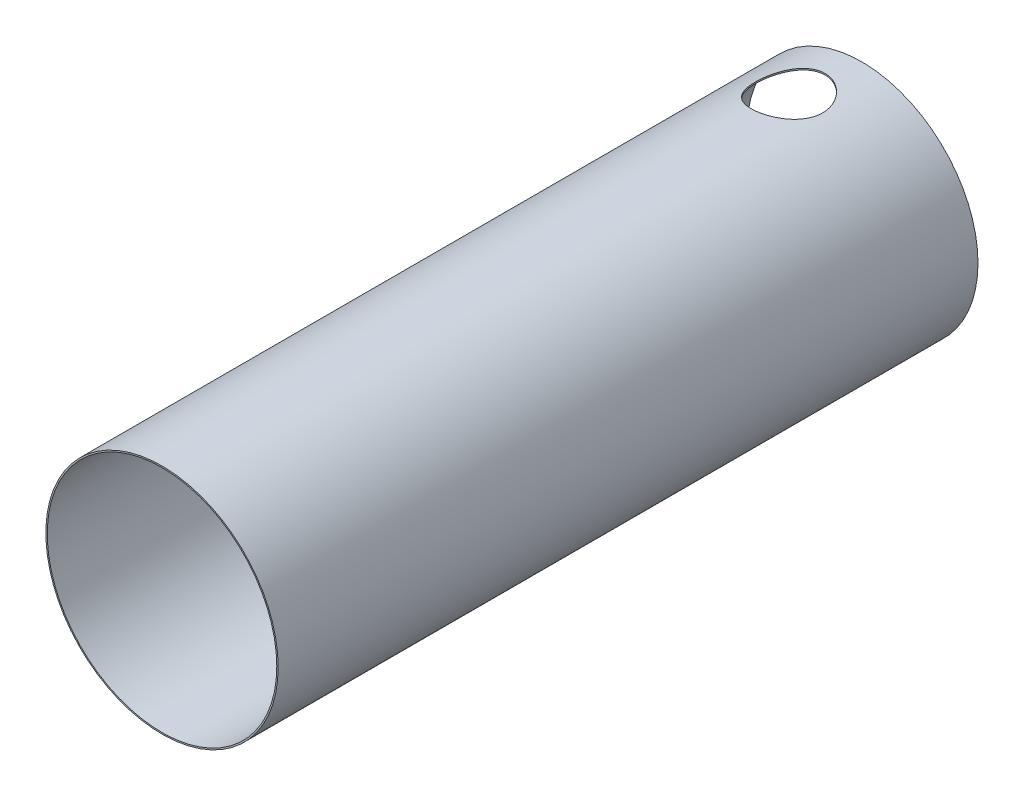
ISO-10303-21;
HEADER;
FILE_DESCRIPTION(('STEP AP214'),'2;1');
FILE_NAME('part.step','',(''),(''),'','','');
FILE_SCHEMA(('AUTOMOTIVE_DESIGN { 1 0 10303 214 1 1 1 1 }'));
ENDSEC;
DATA;
#1=APPLICATION_CONTEXT('core data for automotive mechanical design processes');
#2=APPLICATION_PROTOCOL_DEFINITION('international standard','automotive_design',2000,#1);
#3=PRODUCT_CONTEXT('',#1,'mechanical');
#4=PRODUCT('Part','Part','',(#3));
#5=PRODUCT_RELATED_PRODUCT_CATEGORY('part','',(#4));
#6=PRODUCT_DEFINITION_FORMATION('','',#4);
#7=PRODUCT_DEFINITION_CONTEXT('part definition',#1,'design');
#8=PRODUCT_DEFINITION('design','',#6,#7);
#9=PRODUCT_DEFINITION_SHAPE('','',#8);
#10=(LENGTH_UNIT() NAMED_UNIT(*) SI_UNIT(.MILLI.,.METRE.));
#11=(NAMED_UNIT(*) PLANE_ANGLE_UNIT() SI_UNIT($,.RADIAN.));
#12=(NAMED_UNIT(*) SI_UNIT($,.STERADIAN.) SOLID_ANGLE_UNIT());
#13=UNCERTAINTY_MEASURE_WITH_UNIT(LENGTH_MEASURE(1.E-05),#10,'distance_accuracy_value','');
#14=(GEOMETRIC_REPRESENTATION_CONTEXT(3) GLOBAL_UNCERTAINTY_ASSIGNED_CONTEXT((#13)) GLOBAL_UNIT_ASSIGNED_CONTEXT((#10,
#11,#12)) REPRESENTATION_CONTEXT('',''));
#15=CARTESIAN_POINT('',(0.,0.,0.));
#16=DIRECTION('',(0.,0.,1.));
#17=DIRECTION('',(1.,0.,0.));
#18=AXIS2_PLACEMENT_3D('',#15,#16,#17);
#19=CARTESIAN_POINT('',(0.,0.,125.));
#20=DIRECTION('',(0.,0.,-1.));
#21=DIRECTION('',(-1.,0.,0.));
#22=AXIS2_PLACEMENT_3D('',#19,#20,#21);
#23=CYLINDRICAL_SURFACE('',#22,20.75);
#24=CARTESIAN_POINT('',(0.,0.,125.));
#25=DIRECTION('',(0.,0.,1.));
#26=DIRECTION('',(1.,0.,0.));
#27=AXIS2_PLACEMENT_3D('',#24,#25,#26);
#28=CIRCLE('',#27,20.75);
#29=CARTESIAN_POINT('',(20.75,0.,125.));
#30=VERTEX_POINT('',#29);
#31=EDGE_CURVE('E10',#30,#30,#28,.T.);
#32=ORIENTED_EDGE('',*,*,#31,.F.);
#33=EDGE_LOOP('',(#32));
#34=FACE_BOUND('',#33,.T.);
#35=CARTESIAN_POINT('',(0.,0.,0.));
#36=DIRECTION('',(0.,0.,1.));
#37=DIRECTION('',(1.,0.,0.));
#38=AXIS2_PLACEMENT_3D('',#35,#36,#37);
#39=CIRCLE('',#38,20.75);
#40=CARTESIAN_POINT('',(20.75,0.,0.));
#41=VERTEX_POINT('',#40);
#42=EDGE_CURVE('E40',#41,#41,#39,.T.);
#43=ORIENTED_EDGE('',*,*,#42,.T.);
#44=EDGE_LOOP('',(#43));
#45=FACE_BOUND('',#44,.T.);
#46=CARTESIAN_POINT('',(0.,20.75,5.34314575050762));
#47=CARTESIAN_POINT('',(-0.308284348277854,20.749996274708,5.23415517832771));
#48=CARTESIAN_POINT('',(-0.625546052269505,20.7430677967777,5.15042043919961));
#49=CARTESIAN_POINT('',(-1.26880031894893,20.7136741379048,5.03576464771178));
#50=CARTESIAN_POINT('',(-1.5947938933867,20.6912071489848,5.00484974263634));
#51=CARTESIAN_POINT('',(-2.24577157618452,20.6307005624102,4.99620944335513));
#52=CARTESIAN_POINT('',(-2.57075623479811,20.5926719718474,5.01844650720648));
#53=CARTESIAN_POINT('',(-3.21097157594953,20.5026029820886,5.11456373053897));
#54=CARTESIAN_POINT('',(-3.52620122308127,20.4505611011572,5.18844935254706));
#55=CARTESIAN_POINT('',(-4.14367969794329,20.3345213933555,5.38649037897963));
#56=CARTESIAN_POINT('',(-4.44564596745551,20.2703482088581,5.51141902353659));
#57=CARTESIAN_POINT('',(-5.02426884691195,20.1347345582193,5.80775554531744));
#58=CARTESIAN_POINT('',(-5.30091864525203,20.0632921470885,5.97917588262454));
#59=CARTESIAN_POINT('',(-5.69824383795414,19.9527637710043,6.27221874305129));
#60=CARTESIAN_POINT('',(-5.83053053497626,19.9144467710481,6.37875778362752));
#61=CARTESIAN_POINT('',(-6.08561921158665,19.8379792586638,6.60267396999102));
#62=CARTESIAN_POINT('',(-6.20842435176895,19.7998286947917,6.72004747530968));
#63=CARTESIAN_POINT('',(-6.44384700777414,19.7244680032407,6.96501413967316));
#64=CARTESIAN_POINT('',(-6.55645823691378,19.6872584659575,7.09261351489714));
#65=CARTESIAN_POINT('',(-6.7706183592017,19.6146375367174,7.35717839668783));
#66=CARTESIAN_POINT('',(-6.87217164102685,19.5792254343956,7.49414015212498));
#67=CARTESIAN_POINT('',(-7.06490837914687,19.5105149438053,7.77871730599308));
#68=CARTESIAN_POINT('',(-7.15591999695103,19.4772546791392,7.92645844847072));
#69=CARTESIAN_POINT('',(-7.32504503275851,19.4142823412594,8.22979514593471));
#70=CARTESIAN_POINT('',(-7.40316367988142,19.3845688309163,8.38538748304237));
#71=CARTESIAN_POINT('',(-7.54580652680447,19.329489206932,8.70339561940604));
#72=CARTESIAN_POINT('',(-7.61033332462784,19.3041222626368,8.86581010750564));
#73=CARTESIAN_POINT('',(-7.72513990922679,19.2584666117551,9.19629114247564));
#74=CARTESIAN_POINT('',(-7.77542067574542,19.238177555958,9.36435729977375));
#75=CARTESIAN_POINT('',(-7.85878390609851,19.2042684344528,9.69534022455071));
#76=CARTESIAN_POINT('',(-7.89266691124722,19.1903403880965,9.85802403471899));
#77=CARTESIAN_POINT('',(-7.94685100783337,19.1679660409706,10.1860067824037));
#78=CARTESIAN_POINT('',(-7.96715297705305,19.1595193859236,10.3513055502006));
#79=CARTESIAN_POINT('',(-7.99393971476636,19.1483586561001,10.6831574902856));
#80=CARTESIAN_POINT('',(-8.00042901675062,19.1456427004386,10.8497102329868));
#81=CARTESIAN_POINT('',(-7.999527029626,19.1460196625222,11.1827687636201));
#82=CARTESIAN_POINT('',(-7.99213623068553,19.1491123751371,11.3492745530027));
#83=CARTESIAN_POINT('',(-7.96441318270808,19.1606583429308,11.6710309010101));
#84=CARTESIAN_POINT('',(-7.94487565298543,19.1687823029281,11.8263625774602));
#85=CARTESIAN_POINT('',(-7.8937905047736,19.1898758376795,12.1347553708834));
#86=CARTESIAN_POINT('',(-7.86223897797181,19.2028469892637,12.2878157321149));
#87=CARTESIAN_POINT('',(-7.78744194660948,19.2333011913335,12.5905404579474));
#88=CARTESIAN_POINT('',(-7.74419983977725,19.250782930803,12.740205795594));
#89=CARTESIAN_POINT('',(-7.6463921526522,19.2898408073321,13.0352960344339));
#90=CARTESIAN_POINT('',(-7.59182224392198,19.311418509219,13.1807192903995));
#91=CARTESIAN_POINT('',(-7.47075082893734,19.3585814083041,13.4689564360748));
#92=CARTESIAN_POINT('',(-7.40405454855893,19.3842309989868,13.6116780511512));
#93=CARTESIAN_POINT('',(-7.25993057824466,19.4386686892299,13.8909959564151));
#94=CARTESIAN_POINT('',(-7.18249903392975,19.4674579152462,14.0275900231549));
#95=CARTESIAN_POINT('',(-6.9349438763407,19.5576048296629,14.4270020184708));
#96=CARTESIAN_POINT('',(-6.74947804585195,19.6227746215848,14.6796429332964));
#97=CARTESIAN_POINT('',(-6.32813746011946,19.7628339976407,15.1687560202298));
#98=CARTESIAN_POINT('',(-6.08965348704846,19.8380843648092,15.4028807199967));
#99=CARTESIAN_POINT('',(-5.70550960414979,19.9506287064117,15.7219715191203));
#100=CARTESIAN_POINT('',(-5.57296617066683,19.9881119591239,15.8230396537303));
#101=CARTESIAN_POINT('',(-5.29979412520633,20.0622698564665,16.0138890304446));
#102=CARTESIAN_POINT('',(-5.15916827898489,20.0989447718318,16.1036741004307));
#103=CARTESIAN_POINT('',(-4.86529554150678,20.1721385984021,16.2744699784405));
#104=CARTESIAN_POINT('',(-4.71177405615301,20.2086013573788,16.3550322987335));
#105=CARTESIAN_POINT('',(-4.39795322979504,20.279210003387,16.5027154912608));
#106=CARTESIAN_POINT('',(-4.23765650826997,20.3133567727771,16.569841501771));
#107=CARTESIAN_POINT('',(-3.911268786829,20.3787188261571,16.6901060515149));
#108=CARTESIAN_POINT('',(-3.74517636848009,20.4099333855211,16.7432411390442));
#109=CARTESIAN_POINT('',(-3.40848523289161,20.468852380501,16.8349460469068));
#110=CARTESIAN_POINT('',(-3.23788857225608,20.4965583857134,16.8735223956826));
#111=CARTESIAN_POINT('',(-2.8985121102425,20.5472549514753,16.9347721064773));
#112=CARTESIAN_POINT('',(-2.72982858514179,20.5703610311751,16.957883358767));
#113=CARTESIAN_POINT('',(-2.39067286991908,20.612529407172,16.9896886329033));
#114=CARTESIAN_POINT('',(-2.2202014517096,20.6315933788389,16.9983886381379));
#115=CARTESIAN_POINT('',(-1.87872290516064,20.665486652523,17.0012036039102));
#116=CARTESIAN_POINT('',(-1.70771579885765,20.6803161264799,16.9953191567364));
#117=CARTESIAN_POINT('',(-1.36651480184561,20.7056610422893,16.9689171757462));
#118=CARTESIAN_POINT('',(-1.19632088565387,20.7161766202129,16.9484001035359));
#119=CARTESIAN_POINT('',(-0.865656075911721,20.7325665120861,16.8940711234785));
#120=CARTESIAN_POINT('',(-0.705089946819584,20.7386268198398,16.8608926119392));
#121=CARTESIAN_POINT('',(-0.387065460441317,20.7469995653226,16.7814628124049));
#122=CARTESIAN_POINT('',(-0.229608178162029,20.7493107283051,16.7352070843007));
#123=CARTESIAN_POINT('',(0.0809368038945914,20.7504229678217,16.6299707770341));
#124=CARTESIAN_POINT('',(0.234026174275432,20.7492254050209,16.5709951388019));
#125=CARTESIAN_POINT('',(0.534868912716799,20.7436510962659,16.4407095272921));
#126=CARTESIAN_POINT('',(0.682620259713228,20.7392731591406,16.3693949402355));
#127=CARTESIAN_POINT('',(0.971093549764495,20.7277647260971,16.215288362968));
#128=CARTESIAN_POINT('',(1.11184249582302,20.7206459095352,16.1325460150181));
#129=CARTESIAN_POINT('',(1.38608615342408,20.7041094001712,15.9559089347365));
#130=CARTESIAN_POINT('',(1.51957821318461,20.694690873831,15.8620101650699));
#131=CARTESIAN_POINT('',(1.77835440176497,20.6740611075169,15.6637538226136));
#132=CARTESIAN_POINT('',(1.90364048770062,20.6628502972116,15.5593987587693));
#133=CARTESIAN_POINT('',(2.14528720031756,20.6391615736757,15.3408688258367));
#134=CARTESIAN_POINT('',(2.26164445458319,20.6266831857765,15.2266902806259));
#135=CARTESIAN_POINT('',(2.4875688359325,20.6006740166702,14.9861828395256));
#136=CARTESIAN_POINT('',(2.59687870496403,20.5871242443917,14.8596142281673));
#137=CARTESIAN_POINT('',(2.80458696755509,20.5598582524405,14.5977608605123));
#138=CARTESIAN_POINT('',(2.90298126772335,20.5461419724516,14.4624728642697));
#139=CARTESIAN_POINT('',(3.08812418028429,20.5191311370627,14.1841662812416));
#140=CARTESIAN_POINT('',(3.17487623079014,20.505836458048,14.0411499943017));
#141=CARTESIAN_POINT('',(3.33620177810266,20.4802082787323,13.7482574968614));
#142=CARTESIAN_POINT('',(3.41077078527509,20.4678751336424,13.5983787833857));
#143=CARTESIAN_POINT('',(3.54794468806214,20.444546940122,13.291054561265));
#144=CARTESIAN_POINT('',(3.61040288824567,20.4335688215276,13.1335420834115));
#145=CARTESIAN_POINT('',(3.72182789165916,20.4135656160719,12.8136778992768));
#146=CARTESIAN_POINT('',(3.77078963226267,20.4045412623546,12.6513244023289));
#147=CARTESIAN_POINT('',(3.89673445920024,20.381010447349,12.1588773478514));
#148=CARTESIAN_POINT('',(3.95294837386605,20.3700154520321,11.8230130563776));
#149=CARTESIAN_POINT('',(4.0073911548468,20.3593719270738,11.151820219978));
#150=CARTESIAN_POINT('',(4.00649598181761,20.3595519890337,10.8165624383851));
#151=CARTESIAN_POINT('',(3.94900886849241,20.3707799833097,10.1510114000725));
#152=CARTESIAN_POINT('',(3.89241870027302,20.381827569848,9.82071798573835));
#153=CARTESIAN_POINT('',(3.72593346263022,20.412911209971,9.17696651595244));
#154=CARTESIAN_POINT('',(3.61643657313017,20.4328800383243,8.86340182789528));
#155=CARTESIAN_POINT('',(3.34750587576556,20.4786526339675,8.25889728097834));
#156=CARTESIAN_POINT('',(3.18806335634971,20.5044574189505,7.96796138010635));
#157=CARTESIAN_POINT('',(2.82066187055226,20.5582413074312,7.41195948106676));
#158=CARTESIAN_POINT('',(2.61196567548598,20.5862486493443,7.14738332631092));
#159=CARTESIAN_POINT('',(2.15313718542494,20.6392749361523,6.65670477448859));
#160=CARTESIAN_POINT('',(1.9030144259852,20.6642945664823,6.43059354779873));
#161=CARTESIAN_POINT('',(1.38834847496572,20.7049857135398,6.03857914260235));
#162=CARTESIAN_POINT('',(1.12632852761389,20.721221326002,5.86941479202966));
#163=CARTESIAN_POINT('',(0.578915991564341,20.7437294295604,5.57358823973731));
#164=CARTESIAN_POINT('',(0.293527226055843,20.7500035469677,5.44691910292373));
#165=CARTESIAN_POINT('',(0.,20.75,5.34314575050762));
#166=B_SPLINE_CURVE_WITH_KNOTS('',3,(#46,#47,#48,#49,#50,#51,#52,#53,#54,#55,#56,#57,#58,#59,
#60,#61,#62,#63,#64,#65,#66,#67,#68,#69,#70,#71,#72,#73,#74,#75,#76,#77,#78,#79,#80,#81,#82,#83,
#84,#85,#86,#87,#88,#89,#90,#91,#92,#93,#94,#95,#96,#97,#98,#99,#100,#101,#102,#103,#104,#105,
#106,#107,#108,#109,#110,#111,#112,#113,#114,#115,#116,#117,#118,#119,#120,#121,#122,#123,#124,
#125,#126,#127,#128,#129,#130,#131,#132,#133,#134,#135,#136,#137,#138,#139,#140,#141,#142,#143,
#144,#145,#146,#147,#148,#149,#150,#151,#152,#153,#154,#155,#156,#157,#158,#159,#160,#161,#162,
#163,#164,#165),.UNSPECIFIED.,.T.,.F.,(4,2,2,2,2,2,2,2,2,2,2,2,2,2,2,2,2,2,2,2,2,2,2,2,2,2,2,2,
2,2,2,2,2,2,2,2,2,2,2,2,2,2,2,2,2,2,2,2,2,2,2,2,2,2,2,2,2,2,2,4),(0.,0.979844023512611,
1.95980207558475,2.9390681748006,3.91843786019849,4.91322892704853,5.9082868684359,
6.43015818244706,6.95185477734265,7.47387094633424,7.99567917661818,8.52505850280121,
9.05422259334318,9.58328544448494,10.1123119015228,10.6119358064383,11.1115274160728,
11.6109550281746,12.1103650035866,12.5801129254959,13.0500137933733,13.519778236688,
13.9897225120008,14.4680168192255,14.9464832996616,15.9027865244539,16.9256166843404,
17.4376818765912,17.9495728743895,18.4804345145052,19.0110927545089,19.541881790941,
20.0724325268737,20.5872415201737,21.1018367169321,21.6164110158367,22.1309690825153,
22.6225902807271,23.1143786000375,23.6059762317147,24.0977580803807,24.5874671493514,
25.0773539792887,25.567123543079,26.0570771912941,26.5598480174381,27.0628067522531,
27.5656166281884,28.0686113811904,28.577362854957,29.0863049064497,30.1029402247809,
31.1039858140362,32.1049995535331,33.0985942402951,34.0923623271166,35.1020715188119,
36.1115486181081,37.044641289132,37.9775816080153),.UNSPECIFIED.);
#167=CARTESIAN_POINT('',(0.,20.75,5.34314575050762));
#168=VERTEX_POINT('',#167);
#169=EDGE_CURVE('E52',#168,#168,#166,.T.);
#170=ORIENTED_EDGE('',*,*,#169,.F.);
#171=EDGE_LOOP('',(#170));
#172=FACE_BOUND('',#171,.T.);
#173=ADVANCED_FACE('F28',(#34,#45,#172),#23,.T.);
#174=CARTESIAN_POINT('',(0.,0.,125.));
#175=DIRECTION('',(0.,0.,-1.));
#176=DIRECTION('',(-1.,0.,0.));
#177=AXIS2_PLACEMENT_3D('',#174,#175,#176);
#178=CYLINDRICAL_SURFACE('',#177,20.5);
#179=CARTESIAN_POINT('',(0.,0.,0.));
#180=DIRECTION('',(0.,0.,1.));
#181=DIRECTION('',(1.,0.,0.));
#182=AXIS2_PLACEMENT_3D('',#179,#180,#181);
#183=CIRCLE('',#182,20.5);
#184=CARTESIAN_POINT('',(20.5,0.,0.));
#185=VERTEX_POINT('',#184);
#186=EDGE_CURVE('E49',#185,#185,#183,.T.);
#187=ORIENTED_EDGE('',*,*,#186,.F.);
#188=EDGE_LOOP('',(#187));
#189=FACE_BOUND('',#188,.T.);
#190=CARTESIAN_POINT('',(0.,0.,125.));
#191=DIRECTION('',(0.,0.,1.));
#192=DIRECTION('',(1.,0.,0.));
#193=AXIS2_PLACEMENT_3D('',#190,#191,#192);
#194=CIRCLE('',#193,20.5);
#195=CARTESIAN_POINT('',(20.5,0.,125.));
#196=VERTEX_POINT('',#195);
#197=EDGE_CURVE('E44',#196,#196,#194,.T.);
#198=ORIENTED_EDGE('',*,*,#197,.T.);
#199=EDGE_LOOP('',(#198));
#200=FACE_BOUND('',#199,.T.);
#201=CARTESIAN_POINT('',(-2.,20.4022057631032,5.));
#202=CARTESIAN_POINT('',(-2.16813266879066,20.3857278562803,4.99999434036916));
#203=CARTESIAN_POINT('',(-2.33599954293326,20.367166798634,5.00706808102214));
#204=CARTESIAN_POINT('',(-2.67011599147616,20.3260612282084,5.03518415756389));
#205=CARTESIAN_POINT('',(-2.83636536901129,20.3035162367892,5.05622817271594));
#206=CARTESIAN_POINT('',(-3.1660439218855,20.2547268555979,5.11201975707574));
#207=CARTESIAN_POINT('',(-3.32947211286476,20.2284812027594,5.14677201232947));
#208=CARTESIAN_POINT('',(-3.65239677752524,20.1726760430807,5.22961160009734));
#209=CARTESIAN_POINT('',(-3.81189172487109,20.1431152737142,5.27770402341396));
#210=CARTESIAN_POINT('',(-4.12544307410247,20.0812394943829,5.38662683440286));
#211=CARTESIAN_POINT('',(-4.27951254055115,20.0489318468711,5.44742377113144));
#212=CARTESIAN_POINT('',(-4.58172084970848,19.9820379495472,5.58132242871267));
#213=CARTESIAN_POINT('',(-4.72985745220178,19.9474508518288,5.65442874429042));
#214=CARTESIAN_POINT('',(-5.16390504700845,19.8411823689253,5.89135835764132));
#215=CARTESIAN_POINT('',(-5.439747127519,19.7669344461841,6.07289494333367));
#216=CARTESIAN_POINT('',(-5.96705956475405,19.6143411293636,6.48574113367505));
#217=CARTESIAN_POINT('',(-6.21730465062138,19.5359441837505,6.71859930836429));
#218=CARTESIAN_POINT('',(-6.56076051203538,19.4221795955923,7.09761069147848));
#219=CARTESIAN_POINT('',(-6.66998654382875,19.3848740030167,7.22899499965226));
#220=CARTESIAN_POINT('',(-6.87707170790793,19.312376709978,7.50095144019019));
#221=CARTESIAN_POINT('',(-6.97493551419123,19.2771841431919,7.64151975714036));
#222=CARTESIAN_POINT('',(-7.15941795660278,19.2094375977219,7.93237080859535));
#223=CARTESIAN_POINT('',(-7.24592302476745,19.176911333714,8.08273201366848));
#224=CARTESIAN_POINT('',(-7.40582884048852,19.1157272183856,8.39095074865624));
#225=CARTESIAN_POINT('',(-7.47923504347971,19.0870677578317,8.54880512296257));
#226=CARTESIAN_POINT('',(-7.61225743434998,19.0344072239831,8.8709334635223));
#227=CARTESIAN_POINT('',(-7.67187690325705,19.0104050425477,9.03520589147812));
#228=CARTESIAN_POINT('',(-7.77670386601894,18.9677643738078,9.3689634158481));
#229=CARTESIAN_POINT('',(-7.82191242299914,18.9491254908506,9.53844812672852));
#230=CARTESIAN_POINT('',(-7.89507097493578,18.9187558773775,9.87071884113204));
#231=CARTESIAN_POINT('',(-7.923910340176,18.9066712032338,10.0332770391228));
#232=CARTESIAN_POINT('',(-7.96810965757751,18.888086375121,10.3605285848466));
#233=CARTESIAN_POINT('',(-7.98347044261252,18.8815858760927,10.5252218000135));
#234=CARTESIAN_POINT('',(-8.00053390722886,18.8743620651794,10.8553916124929));
#235=CARTESIAN_POINT('',(-8.00224063414712,18.8736370413277,11.0208679631148));
#236=CARTESIAN_POINT('',(-7.99198622835744,18.8779815607342,11.3513174354466));
#237=CARTESIAN_POINT('',(-7.98002549193013,18.883050935987,11.5162905716079));
#238=CARTESIAN_POINT('',(-7.94363259688666,18.8983878287003,11.835176612164));
#239=CARTESIAN_POINT('',(-7.91994002470102,18.9083468171509,11.989189547438));
#240=CARTESIAN_POINT('',(-7.8607372918476,18.9330356025674,12.2945884552794));
#241=CARTESIAN_POINT('',(-7.82522328802944,18.947766950987,12.4459735566754));
#242=CARTESIAN_POINT('',(-7.74272713346283,18.9816269233671,12.7450330316964));
#243=CARTESIAN_POINT('',(-7.69574803662852,19.0007543762747,12.8927083819399));
#244=CARTESIAN_POINT('',(-7.59071283567875,19.0429588231624,13.1835400138848));
#245=CARTESIAN_POINT('',(-7.53265249309722,19.0660373280314,13.3266945419193));
#246=CARTESIAN_POINT('',(-7.40430916003299,19.1162514903319,13.6112083490222));
#247=CARTESIAN_POINT('',(-7.33375187697724,19.1434757130334,13.752428400491));
#248=CARTESIAN_POINT('',(-7.18202623395547,19.2009135223681,14.0284375155757));
#249=CARTESIAN_POINT('',(-7.10085404817937,19.231128185853,14.1632242364749));
#250=CARTESIAN_POINT('',(-6.84227698058321,19.3252915266493,14.5567955892102));
#251=CARTESIAN_POINT('',(-6.64972760672114,19.3927934695516,14.8049764070743));
#252=CARTESIAN_POINT('',(-6.21386146333998,19.5369933135644,15.2843555129752));
#253=CARTESIAN_POINT('',(-5.96789092738235,19.6140034674408,15.5130520494506));
#254=CARTESIAN_POINT('',(-5.57300534830863,19.7284192557507,15.8230430181666));
#255=CARTESIAN_POINT('',(-5.43696127243495,19.7663981970029,15.9209156029544));
#256=CARTESIAN_POINT('',(-5.15697260309319,19.8412849600614,16.1050524833906));
#257=CARTESIAN_POINT('',(-5.01303078580057,19.8781931513664,16.1913208217659));
#258=CARTESIAN_POINT('',(-4.71334544226546,19.951414299049,16.3542301332054));
#259=CARTESIAN_POINT('',(-4.55737128520907,19.9876699842033,16.4304724928116));
#260=CARTESIAN_POINT('',(-4.23897334287175,20.0576084040668,16.569303787507));
#261=CARTESIAN_POINT('',(-4.07655210375552,20.0912921394562,16.6318980504936));
#262=CARTESIAN_POINT('',(-3.74627766370813,20.1554882838932,16.7428974455379));
#263=CARTESIAN_POINT('',(-3.57842330496278,20.1860000110636,16.7912995307987));
#264=CARTESIAN_POINT('',(-3.23860199330431,20.2432983515665,16.8733637081567));
#265=CARTESIAN_POINT('',(-3.06663694257186,20.2700866502153,16.907032483838));
#266=CARTESIAN_POINT('',(-2.72583504778426,20.3186717034689,16.9583407013166));
#267=CARTESIAN_POINT('',(-2.55709554633219,20.3406089913805,16.9764939961508));
#268=CARTESIAN_POINT('',(-2.2182666197258,20.3803428171312,16.9984303676374));
#269=CARTESIAN_POINT('',(-2.04817778650126,20.3981410769348,17.0022194303328));
#270=CARTESIAN_POINT('',(-1.70790365684668,20.4294458244625,16.9953013027596));
#271=CARTESIAN_POINT('',(-1.53771836356615,20.4429524450417,16.9845945612875));
#272=CARTESIAN_POINT('',(-1.19859497003877,20.4656357650211,16.9486822732336));
#273=CARTESIAN_POINT('',(-1.02965683422321,20.4748125883797,16.9234771417741));
#274=CARTESIAN_POINT('',(-0.701684519780498,20.4886163429133,16.8601234518941));
#275=CARTESIAN_POINT('',(-0.542539437703811,20.493424021313,16.8225864008114));
#276=CARTESIAN_POINT('',(-0.227726613002287,20.4993398549399,16.7346112966899));
#277=CARTESIAN_POINT('',(-0.0720600695741719,20.5004467533183,16.6841688670214));
#278=CARTESIAN_POINT('',(0.234562210099386,20.4992312098365,16.5707667584254));
#279=CARTESIAN_POINT('',(0.385519672609684,20.4969100400954,16.5078117302898));
#280=CARTESIAN_POINT('',(0.681782329565265,20.4891957329846,16.3698006190665));
#281=CARTESIAN_POINT('',(0.827085380627365,20.4838014425932,16.2947400015961));
#282=CARTESIAN_POINT('',(1.11093474327215,20.4703690165866,16.1331033522008));
#283=CARTESIAN_POINT('',(1.24948357068917,20.4623318741638,16.0465316534466));
#284=CARTESIAN_POINT('',(1.51901498254812,20.4440907971796,15.8624252714197));
#285=CARTESIAN_POINT('',(1.64999479580309,20.4338860753324,15.7648866109145));
#286=CARTESIAN_POINT('',(1.90345910123046,20.4118354316724,15.5595615886679));
#287=CARTESIAN_POINT('',(2.02594553811936,20.3999898874309,15.4517775862773));
#288=CARTESIAN_POINT('',(2.2617237320095,20.375197325329,15.2266173156303));
#289=CARTESIAN_POINT('',(2.37501201802227,20.3622498954044,15.1092374595331));
#290=CARTESIAN_POINT('',(2.59458656540684,20.3354539579545,14.8623571700641));
#291=CARTESIAN_POINT('',(2.70059768037261,20.3215905071169,14.7326135183665));
#292=CARTESIAN_POINT('',(2.90144131579485,20.2938887968575,14.4646670180927));
#293=CARTESIAN_POINT('',(2.99626963591411,20.2800505488113,14.3264610204232));
#294=CARTESIAN_POINT('',(3.17403192298962,20.2529900320109,14.0426021920265));
#295=CARTESIAN_POINT('',(3.25696959127738,20.2397675724426,13.8969516978621));
#296=CARTESIAN_POINT('',(3.4104358505531,20.2144745373769,13.5990887990103));
#297=CARTESIAN_POINT('',(3.48095989354914,20.2024043847894,13.4468740146802));
#298=CARTESIAN_POINT('',(3.60964656526265,20.179810765916,13.1355326414744));
#299=CARTESIAN_POINT('',(3.66768877735945,20.1693026443241,12.9763551304993));
#300=CARTESIAN_POINT('',(3.77013565698814,20.1504042952307,12.6535446214279));
#301=CARTESIAN_POINT('',(3.81454020657609,20.1420140860459,12.4899115848117));
#302=CARTESIAN_POINT('',(3.8893567280432,20.1277012347786,12.1593895578098));
#303=CARTESIAN_POINT('',(3.91977031789297,20.1217783073774,11.9925009462399));
#304=CARTESIAN_POINT('',(3.96636512337083,20.1126456080271,11.6566759005448));
#305=CARTESIAN_POINT('',(3.98254657570093,20.1094357909549,11.4877395005248));
#306=CARTESIAN_POINT('',(4.00039402936331,20.1058928705036,11.1519029312766));
#307=CARTESIAN_POINT('',(4.00229787196043,20.1055126318776,10.9850158577548));
#308=CARTESIAN_POINT('',(3.99220138922376,20.1075198522834,10.6516833392009));
#309=CARTESIAN_POINT('',(3.98020142087515,20.1099072402555,10.48523788294));
#310=CARTESIAN_POINT('',(3.94239080946915,20.1173538192702,10.1539555511044));
#311=CARTESIAN_POINT('',(3.91657777622932,20.1224134727139,9.98911895895204));
#312=CARTESIAN_POINT('',(3.85135517190459,20.1349984873103,9.66231677078106));
#313=CARTESIAN_POINT('',(3.81195047300757,20.1425229648521,9.50035016780522));
#314=CARTESIAN_POINT('',(3.72007990369931,20.159691843898,9.1811748667822));
#315=CARTESIAN_POINT('',(3.66768131977851,20.1693252952497,9.02394619712211));
#316=CARTESIAN_POINT('',(3.55013103135793,20.1903474594808,8.71451815738659));
#317=CARTESIAN_POINT('',(3.48498386266858,20.2017355477735,8.5623170210136));
#318=CARTESIAN_POINT('',(3.34235512575092,20.2258224101148,8.26383233985829));
#319=CARTESIAN_POINT('',(3.26486796670593,20.2385217773365,8.11755151521773));
#320=CARTESIAN_POINT('',(3.09814230942881,20.2647138987275,7.83199246730547));
#321=CARTESIAN_POINT('',(3.00890787158095,20.2782063778741,7.69271184733095));
#322=CARTESIAN_POINT('',(2.81759972586668,20.3056797335964,7.41963566598252));
#323=CARTESIAN_POINT('',(2.71532863136874,20.3196650251009,7.28597877709775));
#324=CARTESIAN_POINT('',(2.49994402112784,20.3472863133757,7.02775099973934));
#325=CARTESIAN_POINT('',(2.38683442242112,20.3609224340954,6.90317685720726));
#326=CARTESIAN_POINT('',(2.15043922545081,20.3872449830077,6.66385458672411));
#327=CARTESIAN_POINT('',(2.02714859155081,20.3999309352507,6.54911137910803));
#328=CARTESIAN_POINT('',(1.7713190988944,20.4237342996472,6.33036771004003));
#329=CARTESIAN_POINT('',(1.63878381743668,20.4348523135509,6.22636313139779));
#330=CARTESIAN_POINT('',(1.36473180865427,20.4549862064113,6.02936832795669));
#331=CARTESIAN_POINT('',(1.22317856123689,20.4639927422989,5.93642792075354));
#332=CARTESIAN_POINT('',(0.932670305964878,20.479288949152,5.76281847931921));
#333=CARTESIAN_POINT('',(0.783718162075207,20.48557966236,5.68214474525979));
#334=CARTESIAN_POINT('',(0.479489614879322,20.494956037907,5.53367035699499));
#335=CARTESIAN_POINT('',(0.324215578652896,20.4980428885921,5.46586493742819));
#336=CARTESIAN_POINT('',(0.00851351779128866,20.5006069835474,5.343627541883));
#337=CARTESIAN_POINT('',(-0.151913868671329,20.5000846730612,5.28919391715335));
#338=CARTESIAN_POINT('',(-0.588062906005274,20.4933855866642,5.16153862848012));
#339=CARTESIAN_POINT('',(-0.867545265852514,20.4835834538424,5.10095636964264));
#340=CARTESIAN_POINT('',(-1.43160430383804,20.4519012905446,5.02019234693833));
#341=CARTESIAN_POINT('',(-1.71618085200781,20.4300215677817,5.00000955383397));
#342=CARTESIAN_POINT('',(-2.,20.4022057631032,5.));
#343=B_SPLINE_CURVE_WITH_KNOTS('',3,(#201,#202,#203,#204,#205,#206,#207,#208,#209,#210,#211,
#212,#213,#214,#215,#216,#217,#218,#219,#220,#221,#222,#223,#224,#225,#226,#227,#228,#229,#230,
#231,#232,#233,#234,#235,#236,#237,#238,#239,#240,#241,#242,#243,#244,#245,#246,#247,#248,#249,
#250,#251,#252,#253,#254,#255,#256,#257,#258,#259,#260,#261,#262,#263,#264,#265,#266,#267,#268,
#269,#270,#271,#272,#273,#274,#275,#276,#277,#278,#279,#280,#281,#282,#283,#284,#285,#286,#287,
#288,#289,#290,#291,#292,#293,#294,#295,#296,#297,#298,#299,#300,#301,#302,#303,#304,#305,#306,
#307,#308,#309,#310,#311,#312,#313,#314,#315,#316,#317,#318,#319,#320,#321,#322,#323,#324,#325,
#326,#327,#328,#329,#330,#331,#332,#333,#334,#335,#336,#337,#338,#339,#340,#341,#342),
.UNSPECIFIED.,.T.,.F.,(4,2,2,2,2,2,2,2,2,2,2,2,2,2,2,2,2,2,2,2,2,2,2,2,2,2,2,2,2,2,2,2,2,2,2,2,
2,2,2,2,2,2,2,2,2,2,2,2,2,2,2,2,2,2,2,2,2,2,2,2,2,2,2,2,2,2,2,2,2,2,4),(0.,0.506550685219953,
1.01316227017515,1.51994718630748,2.0269257656451,2.53258592229998,3.03843524699399,
4.04919620142547,5.09612482318421,5.62025714146135,6.14417308146781,6.67298243107752,
7.20157102472305,7.73003369275609,8.25845736588305,8.75443000126334,9.25037198714908,
9.74616696042542,10.2419475587622,10.7098324461231,11.1778695917806,11.6457822039371,
12.1138741479825,12.5939210803538,13.0741415099764,14.0339713899669,15.0627712920196,
15.5778207818063,16.0926903695818,16.6241104618887,17.1553227273283,17.6866489508176,
18.217733894218,18.7304609362137,19.2429742846604,19.7554717658291,20.2679545737444,
20.7581181806224,21.248448238631,21.7385963861633,22.2289285563972,22.7190766683855,
23.2094031122875,23.6996169135554,24.1900148489922,24.6937842257984,25.1977422233131,
25.7015430061883,26.2055279845901,26.7141762742719,27.2228289628227,27.7314228139427,
28.2400082062161,28.7401021847733,29.2401833235286,29.7403510232214,30.240339614421,
30.7377912778662,31.2350662740546,31.7325672124381,32.2298966415643,32.7359307409435,
33.2417826443925,33.7478862630462,34.2537951153686,34.7619020025598,35.2698137214959,
35.7775369832708,36.2851976109702,37.1403107058579,37.9954020151678),.UNSPECIFIED.);
#344=CARTESIAN_POINT('',(-2.,20.4022057631032,5.));
#345=VERTEX_POINT('',#344);
#346=EDGE_CURVE('E32',#345,#345,#343,.T.);
#347=ORIENTED_EDGE('',*,*,#346,.T.);
#348=EDGE_LOOP('',(#347));
#349=FACE_BOUND('',#348,.T.);
#350=ADVANCED_FACE('F61',(#189,#200,#349),#178,.F.);
#351=CARTESIAN_POINT('',(0.,0.,125.));
#352=DIRECTION('',(0.,0.,1.));
#353=DIRECTION('',(1.,0.,0.));
#354=AXIS2_PLACEMENT_3D('',#351,#352,#353);
#355=PLANE('',#354);
#356=ORIENTED_EDGE('',*,*,#31,.T.);
#357=EDGE_LOOP('',(#356));
#358=FACE_BOUND('',#357,.T.);
#359=ORIENTED_EDGE('',*,*,#197,.F.);
#360=EDGE_LOOP('',(#359));
#361=FACE_BOUND('',#360,.T.);
#362=ADVANCED_FACE('F66',(#358,#361),#355,.T.);
#363=CARTESIAN_POINT('',(0.,0.,0.));
#364=DIRECTION('',(0.,0.,1.));
#365=DIRECTION('',(1.,0.,0.));
#366=AXIS2_PLACEMENT_3D('',#363,#364,#365);
#367=PLANE('',#366);
#368=ORIENTED_EDGE('',*,*,#42,.F.);
#369=EDGE_LOOP('',(#368));
#370=FACE_BOUND('',#369,.T.);
#371=ORIENTED_EDGE('',*,*,#186,.T.);
#372=EDGE_LOOP('',(#371));
#373=FACE_BOUND('',#372,.T.);
#374=ADVANCED_FACE('F59',(#370,#373),#367,.F.);
#375=CARTESIAN_POINT('',(-2.,20.75,11.));
#376=DIRECTION('',(0.,-1.,0.));
#377=DIRECTION('',(0.,0.,-1.));
#378=AXIS2_PLACEMENT_3D('',#375,#376,#377);
#379=CYLINDRICAL_SURFACE('',#378,6.);
#380=ORIENTED_EDGE('',*,*,#346,.F.);
#381=EDGE_LOOP('',(#380));
#382=FACE_BOUND('',#381,.T.);
#383=ORIENTED_EDGE('',*,*,#169,.T.);
#384=EDGE_LOOP('',(#383));
#385=FACE_BOUND('',#384,.T.);
#386=ADVANCED_FACE('F56',(#382,#385),#379,.F.);
#387=CLOSED_SHELL('',(#173,#350,#362,#374,#386));
#388=MANIFOLD_SOLID_BREP('B2',#387);
#389=ADVANCED_BREP_SHAPE_REPRESENTATION('',(#18,#388),#14);
#390=SHAPE_DEFINITION_REPRESENTATION(#9,#389);
ENDSEC;
END-ISO-10303-21;
